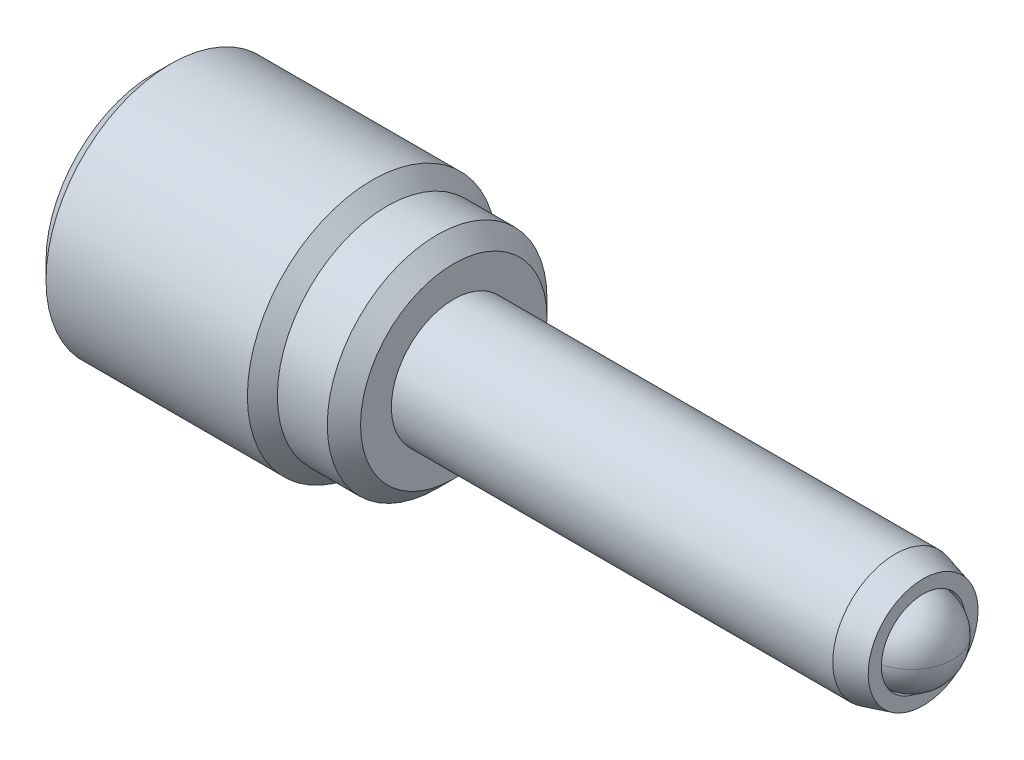
ISO-10303-21;
HEADER;
FILE_DESCRIPTION(('STEP AP214'),'2;1');
FILE_NAME('part.step','',(''),(''),'','','');
FILE_SCHEMA(('AUTOMOTIVE_DESIGN { 1 0 10303 214 1 1 1 1 }'));
ENDSEC;
DATA;
#1=APPLICATION_CONTEXT('core data for automotive mechanical design processes');
#2=APPLICATION_PROTOCOL_DEFINITION('international standard','automotive_design',2000,#1);
#3=PRODUCT_CONTEXT('',#1,'mechanical');
#4=PRODUCT('Part','Part','',(#3));
#5=PRODUCT_RELATED_PRODUCT_CATEGORY('part','',(#4));
#6=PRODUCT_DEFINITION_FORMATION('','',#4);
#7=PRODUCT_DEFINITION_CONTEXT('part definition',#1,'design');
#8=PRODUCT_DEFINITION('design','',#6,#7);
#9=PRODUCT_DEFINITION_SHAPE('','',#8);
#10=(LENGTH_UNIT() NAMED_UNIT(*) SI_UNIT(.MILLI.,.METRE.));
#11=(NAMED_UNIT(*) PLANE_ANGLE_UNIT() SI_UNIT($,.RADIAN.));
#12=(NAMED_UNIT(*) SI_UNIT($,.STERADIAN.) SOLID_ANGLE_UNIT());
#13=UNCERTAINTY_MEASURE_WITH_UNIT(LENGTH_MEASURE(1.E-05),#10,'distance_accuracy_value','');
#14=(GEOMETRIC_REPRESENTATION_CONTEXT(3) GLOBAL_UNCERTAINTY_ASSIGNED_CONTEXT((#13)) GLOBAL_UNIT_ASSIGNED_CONTEXT((#10,
#11,#12)) REPRESENTATION_CONTEXT('',''));
#15=CARTESIAN_POINT('',(0.,0.,0.));
#16=DIRECTION('',(0.,0.,1.));
#17=DIRECTION('',(1.,0.,0.));
#18=AXIS2_PLACEMENT_3D('',#15,#16,#17);
#19=CARTESIAN_POINT('',(-17.018,0.,0.));
#20=DIRECTION('',(-1.,0.,0.));
#21=DIRECTION('',(0.,-1.,0.));
#22=AXIS2_PLACEMENT_3D('',#19,#20,#21);
#23=PLANE('',#22);
#24=CARTESIAN_POINT('',(-17.018,0.,0.));
#25=DIRECTION('',(-1.,0.,0.));
#26=DIRECTION('',(0.,-1.,0.));
#27=AXIS2_PLACEMENT_3D('',#24,#25,#26);
#28=CIRCLE('',#27,4.12749999999999);
#29=CARTESIAN_POINT('',(-17.018,-4.1275,0.));
#30=VERTEX_POINT('',#29);
#31=EDGE_CURVE('P0_E26',#30,#30,#28,.T.);
#32=ORIENTED_EDGE('',*,*,#31,.T.);
#33=EDGE_LOOP('',(#32));
#34=FACE_BOUND('',#33,.T.);
#35=CARTESIAN_POINT('',(-17.018,0.,-2.54));
#36=DIRECTION('',(-1.,0.,0.));
#37=DIRECTION('',(0.,-1.,0.));
#38=AXIS2_PLACEMENT_3D('',#35,#36,#37);
#39=CIRCLE('',#38,1.143);
#40=CARTESIAN_POINT('',(-17.018,-1.143,-2.54));
#41=VERTEX_POINT('',#40);
#42=EDGE_CURVE('P0_E54',#41,#41,#39,.T.);
#43=ORIENTED_EDGE('',*,*,#42,.F.);
#44=EDGE_LOOP('',(#43));
#45=FACE_BOUND('',#44,.T.);
#46=ADVANCED_FACE('P0_F15',(#34,#45),#23,.T.);
#47=CARTESIAN_POINT('',(-5.588,0.,0.));
#48=DIRECTION('',(1.,0.,0.));
#49=DIRECTION('',(0.,1.,0.));
#50=AXIS2_PLACEMENT_3D('',#47,#48,#49);
#51=CYLINDRICAL_SURFACE('',#50,4.7625);
#52=CARTESIAN_POINT('',(-16.383,0.,0.));
#53=DIRECTION('',(-1.,0.,0.));
#54=DIRECTION('',(0.,-1.,0.));
#55=AXIS2_PLACEMENT_3D('',#52,#53,#54);
#56=CIRCLE('',#55,4.7625);
#57=CARTESIAN_POINT('',(-16.383,-4.7625,0.));
#58=VERTEX_POINT('',#57);
#59=EDGE_CURVE('P0_E30',#58,#58,#56,.F.);
#60=ORIENTED_EDGE('',*,*,#59,.T.);
#61=EDGE_LOOP('',(#60));
#62=FACE_BOUND('',#61,.T.);
#63=CARTESIAN_POINT('',(-8.6995,0.,0.));
#64=DIRECTION('',(1.,0.,0.));
#65=DIRECTION('',(0.,1.,0.));
#66=AXIS2_PLACEMENT_3D('',#63,#64,#65);
#67=CIRCLE('',#66,4.7625);
#68=CARTESIAN_POINT('',(-8.6995,4.7625,0.));
#69=VERTEX_POINT('',#68);
#70=EDGE_CURVE('P0_E35',#69,#69,#67,.T.);
#71=ORIENTED_EDGE('',*,*,#70,.F.);
#72=EDGE_LOOP('',(#71));
#73=FACE_BOUND('',#72,.T.);
#74=ADVANCED_FACE('P0_F70',(#62,#73),#51,.T.);
#75=CARTESIAN_POINT('',(-8.128,0.,0.));
#76=DIRECTION('',(-1.,0.,0.));
#77=DIRECTION('',(0.,-1.,0.));
#78=AXIS2_PLACEMENT_3D('',#75,#76,#77);
#79=CONICAL_SURFACE('',#78,4.191,0.785398163397443);
#80=ORIENTED_EDGE('',*,*,#70,.T.);
#81=EDGE_LOOP('',(#80));
#82=FACE_BOUND('',#81,.T.);
#83=CARTESIAN_POINT('',(-8.128,0.,0.));
#84=DIRECTION('',(1.,0.,0.));
#85=DIRECTION('',(0.,1.,0.));
#86=AXIS2_PLACEMENT_3D('',#83,#84,#85);
#87=CIRCLE('',#86,4.191);
#88=CARTESIAN_POINT('',(-8.128,4.191,0.));
#89=VERTEX_POINT('',#88);
#90=EDGE_CURVE('P0_E38',#89,#89,#87,.T.);
#91=ORIENTED_EDGE('',*,*,#90,.F.);
#92=EDGE_LOOP('',(#91));
#93=FACE_BOUND('',#92,.T.);
#94=ADVANCED_FACE('P0_F77',(#82,#93),#79,.T.);
#95=CARTESIAN_POINT('',(-5.588,0.,0.));
#96=DIRECTION('',(1.,0.,0.));
#97=DIRECTION('',(0.,1.,0.));
#98=AXIS2_PLACEMENT_3D('',#95,#96,#97);
#99=CYLINDRICAL_SURFACE('',#98,4.191);
#100=CARTESIAN_POINT('',(-6.223,0.,0.));
#101=DIRECTION('',(1.,0.,0.));
#102=DIRECTION('',(0.,1.,0.));
#103=AXIS2_PLACEMENT_3D('',#100,#101,#102);
#104=CIRCLE('',#103,4.191);
#105=CARTESIAN_POINT('',(-6.223,4.191,0.));
#106=VERTEX_POINT('',#105);
#107=EDGE_CURVE('P0_E10',#106,#106,#104,.F.);
#108=ORIENTED_EDGE('',*,*,#107,.T.);
#109=EDGE_LOOP('',(#108));
#110=FACE_BOUND('',#109,.T.);
#111=ORIENTED_EDGE('',*,*,#90,.T.);
#112=EDGE_LOOP('',(#111));
#113=FACE_BOUND('',#112,.T.);
#114=ADVANCED_FACE('P0_F98',(#110,#113),#99,.T.);
#115=CARTESIAN_POINT('',(-5.588,4.191,0.));
#116=DIRECTION('',(1.,0.,0.));
#117=DIRECTION('',(0.,1.,0.));
#118=AXIS2_PLACEMENT_3D('',#115,#116,#117);
#119=PLANE('',#118);
#120=CARTESIAN_POINT('',(-5.588,0.,0.));
#121=DIRECTION('',(1.,0.,0.));
#122=DIRECTION('',(0.,1.,0.));
#123=AXIS2_PLACEMENT_3D('',#120,#121,#122);
#124=CIRCLE('',#123,3.556);
#125=CARTESIAN_POINT('',(-5.588,3.556,0.));
#126=VERTEX_POINT('',#125);
#127=EDGE_CURVE('P0_E22',#126,#126,#124,.T.);
#128=ORIENTED_EDGE('',*,*,#127,.T.);
#129=EDGE_LOOP('',(#128));
#130=FACE_BOUND('',#129,.T.);
#131=CARTESIAN_POINT('',(-5.588,0.,0.));
#132=DIRECTION('',(1.,0.,0.));
#133=DIRECTION('',(0.,1.,0.));
#134=AXIS2_PLACEMENT_3D('',#131,#132,#133);
#135=CIRCLE('',#134,2.3622);
#136=CARTESIAN_POINT('',(-5.588,2.3622,0.));
#137=VERTEX_POINT('',#136);
#138=EDGE_CURVE('P0_E45',#137,#137,#135,.T.);
#139=ORIENTED_EDGE('',*,*,#138,.F.);
#140=EDGE_LOOP('',(#139));
#141=FACE_BOUND('',#140,.T.);
#142=ADVANCED_FACE('P0_F102',(#130,#141),#119,.T.);
#143=CARTESIAN_POINT('',(-7.874,0.,0.));
#144=DIRECTION('',(1.,0.,0.));
#145=DIRECTION('',(0.,1.,0.));
#146=AXIS2_PLACEMENT_3D('',#143,#144,#145);
#147=CYLINDRICAL_SURFACE('',#146,2.3622);
#148=CARTESIAN_POINT('',(-7.874,0.,0.));
#149=DIRECTION('',(1.,0.,0.));
#150=DIRECTION('',(0.,1.,0.));
#151=AXIS2_PLACEMENT_3D('',#148,#149,#150);
#152=CIRCLE('',#151,2.3622);
#153=CARTESIAN_POINT('',(-7.874,2.3622,0.));
#154=VERTEX_POINT('',#153);
#155=EDGE_CURVE('P0_E44',#154,#154,#152,.T.);
#156=ORIENTED_EDGE('',*,*,#155,.F.);
#157=EDGE_LOOP('',(#156));
#158=FACE_BOUND('',#157,.T.);
#159=ORIENTED_EDGE('',*,*,#138,.T.);
#160=EDGE_LOOP('',(#159));
#161=FACE_BOUND('',#160,.T.);
#162=ADVANCED_FACE('P0_F107',(#158,#161),#147,.F.);
#163=CARTESIAN_POINT('',(-7.874,0.,0.));
#164=DIRECTION('',(1.,0.,0.));
#165=DIRECTION('',(0.,1.,0.));
#166=AXIS2_PLACEMENT_3D('',#163,#164,#165);
#167=PLANE('',#166);
#168=CARTESIAN_POINT('',(-7.874,0.,0.));
#169=DIRECTION('',(1.,0.,0.));
#170=DIRECTION('',(0.,1.,0.));
#171=AXIS2_PLACEMENT_3D('',#168,#169,#170);
#172=CIRCLE('',#171,2.286);
#173=CARTESIAN_POINT('',(-7.874,2.286,0.));
#174=VERTEX_POINT('',#173);
#175=EDGE_CURVE('P0_E48',#174,#174,#172,.T.);
#176=ORIENTED_EDGE('',*,*,#175,.F.);
#177=EDGE_LOOP('',(#176));
#178=FACE_BOUND('',#177,.T.);
#179=ORIENTED_EDGE('',*,*,#155,.T.);
#180=EDGE_LOOP('',(#179));
#181=FACE_BOUND('',#180,.T.);
#182=ADVANCED_FACE('P0_F116',(#178,#181),#167,.T.);
#183=CARTESIAN_POINT('',(-13.462,0.,-9.36162135623731));
#184=DIRECTION('',(1.,0.,0.));
#185=DIRECTION('',(0.,1.,0.));
#186=AXIS2_PLACEMENT_3D('',#183,#184,#185);
#187=PLANE('',#186);
#188=CARTESIAN_POINT('',(-13.462,0.,0.));
#189=DIRECTION('',(1.,0.,0.));
#190=DIRECTION('',(0.,1.,0.));
#191=AXIS2_PLACEMENT_3D('',#188,#189,#190);
#192=CIRCLE('',#191,2.286);
#193=CARTESIAN_POINT('',(-13.462,2.286,0.));
#194=VERTEX_POINT('',#193);
#195=EDGE_CURVE('P0_E41',#194,#194,#192,.T.);
#196=ORIENTED_EDGE('',*,*,#195,.T.);
#197=EDGE_LOOP('',(#196));
#198=FACE_BOUND('',#197,.T.);
#199=ADVANCED_FACE('P0_F112',(#198),#187,.T.);
#200=CARTESIAN_POINT('',(-13.462,0.,0.));
#201=DIRECTION('',(1.,0.,0.));
#202=DIRECTION('',(0.,1.,0.));
#203=AXIS2_PLACEMENT_3D('',#200,#201,#202);
#204=CYLINDRICAL_SURFACE('',#203,2.286);
#205=ORIENTED_EDGE('',*,*,#195,.F.);
#206=EDGE_LOOP('',(#205));
#207=FACE_BOUND('',#206,.T.);
#208=ORIENTED_EDGE('',*,*,#175,.T.);
#209=EDGE_LOOP('',(#208));
#210=FACE_BOUND('',#209,.T.);
#211=ADVANCED_FACE('P0_F65',(#207,#210),#204,.F.);
#212=CARTESIAN_POINT('',(-14.732,0.,-2.54));
#213=DIRECTION('',(-1.,0.,0.));
#214=DIRECTION('',(0.,-1.,0.));
#215=AXIS2_PLACEMENT_3D('',#212,#213,#214);
#216=CYLINDRICAL_SURFACE('',#215,1.143);
#217=CARTESIAN_POINT('',(-14.732,0.,-2.54));
#218=DIRECTION('',(-1.,0.,0.));
#219=DIRECTION('',(0.,-1.,0.));
#220=AXIS2_PLACEMENT_3D('',#217,#218,#219);
#221=CIRCLE('',#220,1.143);
#222=CARTESIAN_POINT('',(-14.732,-1.143,-2.54));
#223=VERTEX_POINT('',#222);
#224=EDGE_CURVE('P0_E53',#223,#223,#221,.T.);
#225=ORIENTED_EDGE('',*,*,#224,.F.);
#226=EDGE_LOOP('',(#225));
#227=FACE_BOUND('',#226,.T.);
#228=ORIENTED_EDGE('',*,*,#42,.T.);
#229=EDGE_LOOP('',(#228));
#230=FACE_BOUND('',#229,.T.);
#231=ADVANCED_FACE('P0_F62',(#227,#230),#216,.F.);
#232=CARTESIAN_POINT('',(-14.732,0.,-2.54));
#233=DIRECTION('',(-1.,0.,0.));
#234=DIRECTION('',(0.,-1.,0.));
#235=AXIS2_PLACEMENT_3D('',#232,#233,#234);
#236=PLANE('',#235);
#237=ORIENTED_EDGE('',*,*,#224,.T.);
#238=EDGE_LOOP('',(#237));
#239=FACE_BOUND('',#238,.T.);
#240=ADVANCED_FACE('P0_F60',(#239),#236,.T.);
#241=CARTESIAN_POINT('',(-16.383,0.,0.));
#242=DIRECTION('',(1.,0.,0.));
#243=DIRECTION('',(0.,1.,0.));
#244=AXIS2_PLACEMENT_3D('',#241,#242,#243);
#245=CONICAL_SURFACE('',#244,4.7625,0.78539816339745);
#246=ORIENTED_EDGE('',*,*,#31,.F.);
#247=EDGE_LOOP('',(#246));
#248=FACE_BOUND('',#247,.T.);
#249=ORIENTED_EDGE('',*,*,#59,.F.);
#250=EDGE_LOOP('',(#249));
#251=FACE_BOUND('',#250,.T.);
#252=ADVANCED_FACE('P0_F81',(#248,#251),#245,.T.);
#253=CARTESIAN_POINT('',(-5.588,0.,0.));
#254=DIRECTION('',(-1.,0.,0.));
#255=DIRECTION('',(0.,-1.,0.));
#256=AXIS2_PLACEMENT_3D('',#253,#254,#255);
#257=CONICAL_SURFACE('',#256,3.556,0.785398163397447);
#258=ORIENTED_EDGE('',*,*,#107,.F.);
#259=EDGE_LOOP('',(#258));
#260=FACE_BOUND('',#259,.T.);
#261=ORIENTED_EDGE('',*,*,#127,.F.);
#262=EDGE_LOOP('',(#261));
#263=FACE_BOUND('',#262,.T.);
#264=ADVANCED_FACE('P0_F17',(#260,#263),#257,.T.);
#265=CLOSED_SHELL('',(#46,#74,#94,#114,#142,#162,#182,#199,#211,#231,#240,#252,#264));
#266=MANIFOLD_SOLID_BREP('P0_B1',#265);
#267=CARTESIAN_POINT('',(-13.462,0.,0.));
#268=DIRECTION('',(-1.,0.,0.));
#269=DIRECTION('',(0.,-1.,0.));
#270=AXIS2_PLACEMENT_3D('',#267,#268,#269);
#271=PLANE('',#270);
#272=CARTESIAN_POINT('',(-13.462,0.,0.));
#273=DIRECTION('',(1.,0.,0.));
#274=DIRECTION('',(0.,1.,0.));
#275=AXIS2_PLACEMENT_3D('',#272,#273,#274);
#276=CIRCLE('',#275,2.12725);
#277=CARTESIAN_POINT('',(-13.462,2.12725,0.));
#278=VERTEX_POINT('',#277);
#279=EDGE_CURVE('P1_E11',#278,#278,#276,.T.);
#280=ORIENTED_EDGE('',*,*,#279,.F.);
#281=EDGE_LOOP('',(#280));
#282=FACE_BOUND('',#281,.T.);
#283=ADVANCED_FACE('P1_F17',(#282),#271,.T.);
#284=CARTESIAN_POINT('',(-13.208,0.,0.));
#285=DIRECTION('',(1.,0.,0.));
#286=DIRECTION('',(0.,1.,0.));
#287=AXIS2_PLACEMENT_3D('',#284,#285,#286);
#288=CONICAL_SURFACE('',#287,2.38125,0.785398163397454);
#289=ORIENTED_EDGE('',*,*,#279,.T.);
#290=EDGE_LOOP('',(#289));
#291=FACE_BOUND('',#290,.T.);
#292=CARTESIAN_POINT('',(-13.208,0.,0.));
#293=DIRECTION('',(1.,0.,0.));
#294=DIRECTION('',(0.,1.,0.));
#295=AXIS2_PLACEMENT_3D('',#292,#293,#294);
#296=CIRCLE('',#295,2.38125);
#297=CARTESIAN_POINT('',(-13.208,2.38125,0.));
#298=VERTEX_POINT('',#297);
#299=EDGE_CURVE('P1_E23',#298,#298,#296,.T.);
#300=ORIENTED_EDGE('',*,*,#299,.F.);
#301=EDGE_LOOP('',(#300));
#302=FACE_BOUND('',#301,.T.);
#303=ADVANCED_FACE('P1_F41',(#291,#302),#288,.T.);
#304=CARTESIAN_POINT('',(9.62943596973271,0.,0.));
#305=DIRECTION('',(1.,0.,0.));
#306=DIRECTION('',(0.,1.,0.));
#307=AXIS2_PLACEMENT_3D('',#304,#305,#306);
#308=CYLINDRICAL_SURFACE('',#307,2.38125);
#309=ORIENTED_EDGE('',*,*,#299,.T.);
#310=EDGE_LOOP('',(#309));
#311=FACE_BOUND('',#310,.T.);
#312=CARTESIAN_POINT('',(11.2525664817372,0.,0.));
#313=DIRECTION('',(1.,0.,0.));
#314=DIRECTION('',(0.,1.,0.));
#315=AXIS2_PLACEMENT_3D('',#312,#313,#314);
#316=CIRCLE('',#315,2.38125);
#317=CARTESIAN_POINT('',(11.2525664817372,2.38125,0.));
#318=VERTEX_POINT('',#317);
#319=EDGE_CURVE('P1_E54',#318,#318,#316,.T.);
#320=ORIENTED_EDGE('',*,*,#319,.F.);
#321=EDGE_LOOP('',(#320));
#322=FACE_BOUND('',#321,.T.);
#323=ADVANCED_FACE('P1_F47',(#311,#322),#308,.T.);
#324=CARTESIAN_POINT('',(12.319,0.,0.));
#325=DIRECTION('',(-1.,0.,0.));
#326=DIRECTION('',(0.,-1.,0.));
#327=AXIS2_PLACEMENT_3D('',#324,#325,#326);
#328=CONICAL_SURFACE('',#327,2.0955,0.261799387799143);
#329=ORIENTED_EDGE('',*,*,#319,.T.);
#330=EDGE_LOOP('',(#329));
#331=FACE_BOUND('',#330,.T.);
#332=CARTESIAN_POINT('',(12.319,0.,0.));
#333=DIRECTION('',(1.,0.,0.));
#334=DIRECTION('',(0.,1.,0.));
#335=AXIS2_PLACEMENT_3D('',#332,#333,#334);
#336=CIRCLE('',#335,2.0955);
#337=CARTESIAN_POINT('',(12.319,2.0955,0.));
#338=VERTEX_POINT('',#337);
#339=EDGE_CURVE('P1_E56',#338,#338,#336,.T.);
#340=ORIENTED_EDGE('',*,*,#339,.F.);
#341=EDGE_LOOP('',(#340));
#342=FACE_BOUND('',#341,.T.);
#343=ADVANCED_FACE('P1_F70',(#331,#342),#328,.T.);
#344=CARTESIAN_POINT('',(12.319,2.0955,0.));
#345=DIRECTION('',(1.,0.,0.));
#346=DIRECTION('',(0.,1.,0.));
#347=AXIS2_PLACEMENT_3D('',#344,#345,#346);
#348=PLANE('',#347);
#349=ORIENTED_EDGE('',*,*,#339,.T.);
#350=EDGE_LOOP('',(#349));
#351=FACE_BOUND('',#350,.T.);
#352=CARTESIAN_POINT('',(12.319,0.,0.));
#353=DIRECTION('',(1.,0.,0.));
#354=DIRECTION('',(0.,1.,0.));
#355=AXIS2_PLACEMENT_3D('',#352,#353,#354);
#356=CIRCLE('',#355,1.59385);
#357=CARTESIAN_POINT('',(12.319,1.59385,0.));
#358=VERTEX_POINT('',#357);
#359=EDGE_CURVE('P1_E61',#358,#358,#356,.T.);
#360=ORIENTED_EDGE('',*,*,#359,.F.);
#361=EDGE_LOOP('',(#360));
#362=FACE_BOUND('',#361,.T.);
#363=ADVANCED_FACE('P1_F36',(#351,#362),#348,.T.);
#364=CARTESIAN_POINT('',(9.62943596973271,0.,0.));
#365=DIRECTION('',(1.,0.,0.));
#366=DIRECTION('',(0.,1.,0.));
#367=AXIS2_PLACEMENT_3D('',#364,#365,#366);
#368=CYLINDRICAL_SURFACE('',#367,1.59385);
#369=ORIENTED_EDGE('',*,*,#359,.T.);
#370=EDGE_LOOP('',(#369));
#371=FACE_BOUND('',#370,.T.);
#372=CARTESIAN_POINT('',(11.2232859697327,0.,0.));
#373=DIRECTION('',(1.,0.,0.));
#374=DIRECTION('',(0.,1.,0.));
#375=AXIS2_PLACEMENT_3D('',#372,#373,#374);
#376=CIRCLE('',#375,1.59385);
#377=CARTESIAN_POINT('',(11.2232859697327,1.59385,0.));
#378=VERTEX_POINT('',#377);
#379=EDGE_CURVE('P1_E64',#378,#378,#376,.T.);
#380=ORIENTED_EDGE('',*,*,#379,.F.);
#381=EDGE_LOOP('',(#380));
#382=FACE_BOUND('',#381,.T.);
#383=ADVANCED_FACE('P1_F28',(#371,#382),#368,.F.);
#384=CARTESIAN_POINT('',(9.62943596973271,0.,0.));
#385=DIRECTION('',(1.,0.,0.));
#386=DIRECTION('',(0.,1.,0.));
#387=AXIS2_PLACEMENT_3D('',#384,#385,#386);
#388=CONICAL_SURFACE('',#387,0.,0.78539816339745);
#389=ORIENTED_EDGE('',*,*,#379,.T.);
#390=EDGE_LOOP('',(#389));
#391=FACE_BOUND('',#390,.T.);
#392=CARTESIAN_POINT('',(9.62943596973271,0.,0.));
#393=VERTEX_POINT('',#392);
#394=VERTEX_LOOP('',#393);
#395=FACE_BOUND('',#394,.T.);
#396=ADVANCED_FACE('P1_F26',(#391,#395),#388,.F.);
#397=CLOSED_SHELL('',(#283,#303,#323,#343,#363,#383,#396));
#398=MANIFOLD_SOLID_BREP('P1_B1',#397);
#399=CARTESIAN_POINT('',(-15.827375,-0.00653754846686839,-2.58717415696166));
#400=DIRECTION('',(0.,0.,1.));
#401=DIRECTION('',(0.,1.,0.));
#402=AXIS2_PLACEMENT_3D('',#399,#400,#401);
#403=SPHERICAL_SURFACE('',#402,1.190625);
#404=CARTESIAN_POINT('',(-15.827375,-0.00653754846686861,-1.39654915696166));
#405=VERTEX_POINT('',#404);
#406=VERTEX_LOOP('',#405);
#407=FACE_BOUND('',#406,.T.);
#408=ADVANCED_FACE('P2_F13',(#407),#403,.T.);
#409=CLOSED_SHELL('',(#408));
#410=MANIFOLD_SOLID_BREP('P2_B1',#409);
#411=CARTESIAN_POINT('',(11.8745,0.,0.));
#412=DIRECTION('',(0.,0.,-1.));
#413=DIRECTION('',(0.,-1.,0.));
#414=AXIS2_PLACEMENT_3D('',#411,#412,#413);
#415=SPHERICAL_SURFACE('',#414,1.5875);
#416=CARTESIAN_POINT('',(11.8745,0.,0.));
#417=DIRECTION('',(-1.,0.,0.));
#418=DIRECTION('',(0.,-1.,0.));
#419=AXIS2_PLACEMENT_3D('',#416,#417,#418);
#420=CIRCLE('',#419,1.5875);
#421=CARTESIAN_POINT('',(11.8745,0.,1.5875));
#422=VERTEX_POINT('',#421);
#423=CARTESIAN_POINT('',(11.8745,0.,-1.5875));
#424=VERTEX_POINT('',#423);
#425=EDGE_CURVE('P3_E37',#422,#424,#420,.T.);
#426=ORIENTED_EDGE('',*,*,#425,.F.);
#427=CARTESIAN_POINT('',(11.8745,0.,0.));
#428=DIRECTION('',(0.,1.,0.));
#429=DIRECTION('',(-1.,0.,0.));
#430=AXIS2_PLACEMENT_3D('',#427,#428,#429);
#431=CIRCLE('',#430,1.5875);
#432=EDGE_CURVE('P3_E10',#422,#424,#431,.T.);
#433=ORIENTED_EDGE('',*,*,#432,.T.);
#434=EDGE_LOOP('',(#426,#433));
#435=FACE_BOUND('',#434,.T.);
#436=ADVANCED_FACE('P3_F16',(#435),#415,.T.);
#437=ORIENTED_EDGE('',*,*,#425,.T.);
#438=CARTESIAN_POINT('',(11.8745,0.,0.));
#439=DIRECTION('',(0.,1.,0.));
#440=DIRECTION('',(-1.,0.,0.));
#441=AXIS2_PLACEMENT_3D('',#438,#439,#440);
#442=CIRCLE('',#441,1.5875);
#443=EDGE_CURVE('P3_E23',#424,#422,#442,.T.);
#444=ORIENTED_EDGE('',*,*,#443,.T.);
#445=EDGE_LOOP('',(#437,#444));
#446=FACE_BOUND('',#445,.T.);
#447=ADVANCED_FACE('P3_F36',(#446),#415,.T.);
#448=ORIENTED_EDGE('',*,*,#443,.F.);
#449=EDGE_CURVE('P3_E33',#424,#422,#420,.T.);
#450=ORIENTED_EDGE('',*,*,#449,.T.);
#451=EDGE_LOOP('',(#448,#450));
#452=FACE_BOUND('',#451,.T.);
#453=ADVANCED_FACE('P3_F39',(#452),#415,.T.);
#454=ORIENTED_EDGE('',*,*,#432,.F.);
#455=ORIENTED_EDGE('',*,*,#449,.F.);
#456=EDGE_LOOP('',(#454,#455));
#457=FACE_BOUND('',#456,.T.);
#458=ADVANCED_FACE('P3_F18',(#457),#415,.T.);
#459=CLOSED_SHELL('',(#436,#447,#453,#458));
#460=MANIFOLD_SOLID_BREP('P3_B1',#459);
#461=ADVANCED_BREP_SHAPE_REPRESENTATION('',(#18,#266,#398,#410,#460),#14);
#462=SHAPE_DEFINITION_REPRESENTATION(#9,#461);
ENDSEC;
END-ISO-10303-21;
